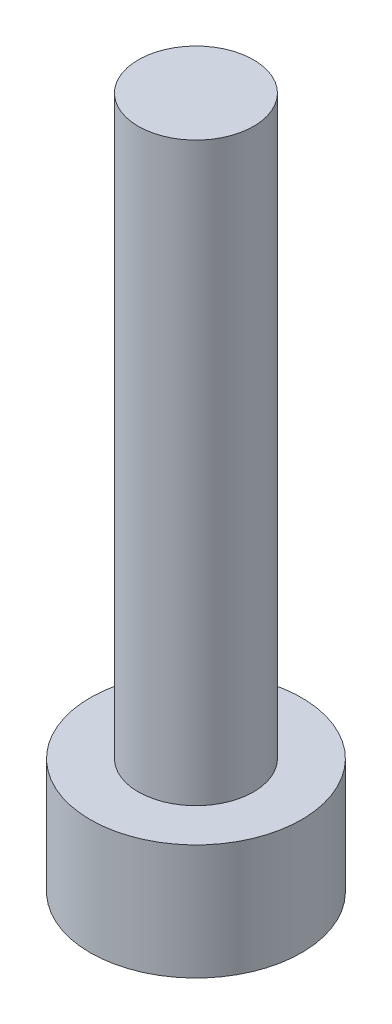
ISO-10303-21;
HEADER;
FILE_DESCRIPTION(('STEP AP214'),'2;1');
FILE_NAME('part.step','',(''),(''),'','','');
FILE_SCHEMA(('AUTOMOTIVE_DESIGN { 1 0 10303 214 1 1 1 1 }'));
ENDSEC;
DATA;
#1=APPLICATION_CONTEXT('core data for automotive mechanical design processes');
#2=APPLICATION_PROTOCOL_DEFINITION('international standard','automotive_design',2000,#1);
#3=PRODUCT_CONTEXT('',#1,'mechanical');
#4=PRODUCT('Part','Part','',(#3));
#5=PRODUCT_RELATED_PRODUCT_CATEGORY('part','',(#4));
#6=PRODUCT_DEFINITION_FORMATION('','',#4);
#7=PRODUCT_DEFINITION_CONTEXT('part definition',#1,'design');
#8=PRODUCT_DEFINITION('design','',#6,#7);
#9=PRODUCT_DEFINITION_SHAPE('','',#8);
#10=(LENGTH_UNIT() NAMED_UNIT(*) SI_UNIT(.MILLI.,.METRE.));
#11=(NAMED_UNIT(*) PLANE_ANGLE_UNIT() SI_UNIT($,.RADIAN.));
#12=(NAMED_UNIT(*) SI_UNIT($,.STERADIAN.) SOLID_ANGLE_UNIT());
#13=UNCERTAINTY_MEASURE_WITH_UNIT(LENGTH_MEASURE(1.E-05),#10,'distance_accuracy_value','');
#14=(GEOMETRIC_REPRESENTATION_CONTEXT(3) GLOBAL_UNCERTAINTY_ASSIGNED_CONTEXT((#13)) GLOBAL_UNIT_ASSIGNED_CONTEXT((#10,
#11,#12)) REPRESENTATION_CONTEXT('',''));
#15=CARTESIAN_POINT('',(0.,0.,0.));
#16=DIRECTION('',(0.,0.,1.));
#17=DIRECTION('',(1.,0.,0.));
#18=AXIS2_PLACEMENT_3D('',#15,#16,#17);
#19=CARTESIAN_POINT('',(0.,3.,0.));
#20=DIRECTION('',(0.,1.,0.));
#21=DIRECTION('',(0.,0.,1.));
#22=AXIS2_PLACEMENT_3D('',#19,#20,#21);
#23=PLANE('',#22);
#24=CARTESIAN_POINT('',(0.,3.,0.));
#25=DIRECTION('',(0.,1.,0.));
#26=DIRECTION('',(0.,0.,1.));
#27=AXIS2_PLACEMENT_3D('',#24,#25,#26);
#28=CIRCLE('',#27,2.75);
#29=CARTESIAN_POINT('',(0.,3.,2.75));
#30=VERTEX_POINT('',#29);
#31=EDGE_CURVE('E11',#30,#30,#28,.T.);
#32=ORIENTED_EDGE('',*,*,#31,.T.);
#33=EDGE_LOOP('',(#32));
#34=FACE_BOUND('',#33,.T.);
#35=CARTESIAN_POINT('',(0.,3.,0.));
#36=DIRECTION('',(0.,1.,0.));
#37=DIRECTION('',(0.,0.,1.));
#38=AXIS2_PLACEMENT_3D('',#35,#36,#37);
#39=CIRCLE('',#38,1.5);
#40=CARTESIAN_POINT('',(0.,3.,1.5));
#41=VERTEX_POINT('',#40);
#42=EDGE_CURVE('E135',#41,#41,#39,.T.);
#43=ORIENTED_EDGE('',*,*,#42,.F.);
#44=EDGE_LOOP('',(#43));
#45=FACE_BOUND('',#44,.T.);
#46=ADVANCED_FACE('F33',(#34,#45),#23,.T.);
#47=CARTESIAN_POINT('',(0.,3.,0.));
#48=DIRECTION('',(0.,-1.,0.));
#49=DIRECTION('',(0.,0.,-1.));
#50=AXIS2_PLACEMENT_3D('',#47,#48,#49);
#51=CYLINDRICAL_SURFACE('',#50,2.75);
#52=ORIENTED_EDGE('',*,*,#31,.F.);
#53=EDGE_LOOP('',(#52));
#54=FACE_BOUND('',#53,.T.);
#55=CARTESIAN_POINT('',(0.,0.,0.));
#56=DIRECTION('',(0.,1.,0.));
#57=DIRECTION('',(0.,0.,1.));
#58=AXIS2_PLACEMENT_3D('',#55,#56,#57);
#59=CIRCLE('',#58,2.75);
#60=CARTESIAN_POINT('',(0.,0.,2.75));
#61=VERTEX_POINT('',#60);
#62=EDGE_CURVE('E37',#61,#61,#59,.T.);
#63=ORIENTED_EDGE('',*,*,#62,.T.);
#64=EDGE_LOOP('',(#63));
#65=FACE_BOUND('',#64,.T.);
#66=ADVANCED_FACE('F35',(#54,#65),#51,.T.);
#67=CARTESIAN_POINT('',(0.,0.,0.));
#68=DIRECTION('',(0.,1.,0.));
#69=DIRECTION('',(0.,0.,1.));
#70=AXIS2_PLACEMENT_3D('',#67,#68,#69);
#71=PLANE('',#70);
#72=DIRECTION('',(-0.866025403784439,0.,-0.5));
#73=VECTOR('',#72,1.);
#74=CARTESIAN_POINT('',(0.,0.,1.44337567297406));
#75=LINE('',#74,#73);
#76=CARTESIAN_POINT('',(0.,0.,1.44337567297406));
#77=VERTEX_POINT('',#76);
#78=CARTESIAN_POINT('',(-1.25,0.,0.721687836487033));
#79=VERTEX_POINT('',#78);
#80=EDGE_CURVE('E122',#77,#79,#75,.T.);
#81=ORIENTED_EDGE('',*,*,#80,.F.);
#82=DIRECTION('',(-0.866025403784439,0.,0.5));
#83=VECTOR('',#82,1.);
#84=CARTESIAN_POINT('',(1.25,0.,0.721687836487032));
#85=LINE('',#84,#83);
#86=CARTESIAN_POINT('',(1.25,0.,0.721687836487032));
#87=VERTEX_POINT('',#86);
#88=EDGE_CURVE('E48',#87,#77,#85,.T.);
#89=ORIENTED_EDGE('',*,*,#88,.F.);
#90=DIRECTION('',(0.,0.,1.));
#91=VECTOR('',#90,1.);
#92=CARTESIAN_POINT('',(1.25,0.,-0.721687836487033));
#93=LINE('',#92,#91);
#94=CARTESIAN_POINT('',(1.25,0.,-0.721687836487033));
#95=VERTEX_POINT('',#94);
#96=EDGE_CURVE('E131',#95,#87,#93,.T.);
#97=ORIENTED_EDGE('',*,*,#96,.F.);
#98=DIRECTION('',(0.866025403784439,0.,0.5));
#99=VECTOR('',#98,1.);
#100=CARTESIAN_POINT('',(0.,0.,-1.44337567297406));
#101=LINE('',#100,#99);
#102=CARTESIAN_POINT('',(0.,0.,-1.44337567297406));
#103=VERTEX_POINT('',#102);
#104=EDGE_CURVE('E129',#103,#95,#101,.T.);
#105=ORIENTED_EDGE('',*,*,#104,.F.);
#106=DIRECTION('',(0.866025403784439,0.,-0.5));
#107=VECTOR('',#106,1.);
#108=CARTESIAN_POINT('',(-1.25,0.,-0.721687836487032));
#109=LINE('',#108,#107);
#110=CARTESIAN_POINT('',(-1.25,0.,-0.721687836487032));
#111=VERTEX_POINT('',#110);
#112=EDGE_CURVE('E96',#111,#103,#109,.T.);
#113=ORIENTED_EDGE('',*,*,#112,.F.);
#114=DIRECTION('',(0.,0.,-1.));
#115=VECTOR('',#114,1.);
#116=CARTESIAN_POINT('',(-1.25,0.,0.721687836487033));
#117=LINE('',#116,#115);
#118=EDGE_CURVE('E125',#79,#111,#117,.T.);
#119=ORIENTED_EDGE('',*,*,#118,.F.);
#120=EDGE_LOOP('',(#81,#89,#97,#105,#113,#119));
#121=FACE_BOUND('',#120,.T.);
#122=ORIENTED_EDGE('',*,*,#62,.F.);
#123=EDGE_LOOP('',(#122));
#124=FACE_BOUND('',#123,.T.);
#125=ADVANCED_FACE('F155',(#121,#124),#71,.F.);
#126=CARTESIAN_POINT('',(0.,18.,0.));
#127=DIRECTION('',(0.,-1.,0.));
#128=DIRECTION('',(0.,0.,-1.));
#129=AXIS2_PLACEMENT_3D('',#126,#127,#128);
#130=CYLINDRICAL_SURFACE('',#129,1.5);
#131=CARTESIAN_POINT('',(0.,18.,0.));
#132=DIRECTION('',(0.,1.,0.));
#133=DIRECTION('',(0.,0.,1.));
#134=AXIS2_PLACEMENT_3D('',#131,#132,#133);
#135=CIRCLE('',#134,1.5);
#136=CARTESIAN_POINT('',(0.,18.,1.5));
#137=VERTEX_POINT('',#136);
#138=EDGE_CURVE('E141',#137,#137,#135,.T.);
#139=ORIENTED_EDGE('',*,*,#138,.F.);
#140=EDGE_LOOP('',(#139));
#141=FACE_BOUND('',#140,.T.);
#142=ORIENTED_EDGE('',*,*,#42,.T.);
#143=EDGE_LOOP('',(#142));
#144=FACE_BOUND('',#143,.T.);
#145=ADVANCED_FACE('F147',(#141,#144),#130,.T.);
#146=CARTESIAN_POINT('',(0.,18.,0.));
#147=DIRECTION('',(0.,1.,0.));
#148=DIRECTION('',(0.,0.,1.));
#149=AXIS2_PLACEMENT_3D('',#146,#147,#148);
#150=PLANE('',#149);
#151=ORIENTED_EDGE('',*,*,#138,.T.);
#152=EDGE_LOOP('',(#151));
#153=FACE_BOUND('',#152,.T.);
#154=ADVANCED_FACE('F164',(#153),#150,.T.);
#155=CARTESIAN_POINT('',(1.25,1.5,0.721687836487032));
#156=DIRECTION('',(0.5,0.,0.866025403784439));
#157=DIRECTION('',(0.866025403784439,0.,-0.5));
#158=AXIS2_PLACEMENT_3D('',#155,#156,#157);
#159=PLANE('',#158);
#160=ORIENTED_EDGE('',*,*,#88,.T.);
#161=DIRECTION('',(0.,-1.,0.));
#162=VECTOR('',#161,1.);
#163=CARTESIAN_POINT('',(0.,1.5,1.44337567297406));
#164=LINE('',#163,#162);
#165=CARTESIAN_POINT('',(0.,1.5,1.44337567297406));
#166=VERTEX_POINT('',#165);
#167=EDGE_CURVE('E78',#166,#77,#164,.T.);
#168=ORIENTED_EDGE('',*,*,#167,.F.);
#169=DIRECTION('',(-0.866025403784439,0.,0.5));
#170=VECTOR('',#169,1.);
#171=CARTESIAN_POINT('',(1.25,1.5,0.721687836487032));
#172=LINE('',#171,#170);
#173=CARTESIAN_POINT('',(1.25,1.5,0.721687836487032));
#174=VERTEX_POINT('',#173);
#175=EDGE_CURVE('E133',#174,#166,#172,.T.);
#176=ORIENTED_EDGE('',*,*,#175,.F.);
#177=DIRECTION('',(0.,-1.,0.));
#178=VECTOR('',#177,1.);
#179=CARTESIAN_POINT('',(1.25,1.5,0.721687836487032));
#180=LINE('',#179,#178);
#181=EDGE_CURVE('E56',#174,#87,#180,.T.);
#182=ORIENTED_EDGE('',*,*,#181,.T.);
#183=EDGE_LOOP('',(#160,#168,#176,#182));
#184=FACE_BOUND('',#183,.T.);
#185=ADVANCED_FACE('F176',(#184),#159,.F.);
#186=CARTESIAN_POINT('',(1.25,1.5,-0.721687836487033));
#187=DIRECTION('',(1.,0.,0.));
#188=DIRECTION('',(0.,0.,-1.));
#189=AXIS2_PLACEMENT_3D('',#186,#187,#188);
#190=PLANE('',#189);
#191=ORIENTED_EDGE('',*,*,#96,.T.);
#192=ORIENTED_EDGE('',*,*,#181,.F.);
#193=DIRECTION('',(0.,0.,1.));
#194=VECTOR('',#193,1.);
#195=CARTESIAN_POINT('',(1.25,1.5,-0.721687836487033));
#196=LINE('',#195,#194);
#197=CARTESIAN_POINT('',(1.25,1.5,-0.721687836487033));
#198=VERTEX_POINT('',#197);
#199=EDGE_CURVE('E108',#198,#174,#196,.T.);
#200=ORIENTED_EDGE('',*,*,#199,.F.);
#201=DIRECTION('',(0.,-1.,0.));
#202=VECTOR('',#201,1.);
#203=CARTESIAN_POINT('',(1.25,1.5,-0.721687836487033));
#204=LINE('',#203,#202);
#205=EDGE_CURVE('E100',#198,#95,#204,.T.);
#206=ORIENTED_EDGE('',*,*,#205,.T.);
#207=EDGE_LOOP('',(#191,#192,#200,#206));
#208=FACE_BOUND('',#207,.T.);
#209=ADVANCED_FACE('F178',(#208),#190,.F.);
#210=CARTESIAN_POINT('',(0.,1.5,-1.44337567297406));
#211=DIRECTION('',(0.5,0.,-0.866025403784439));
#212=DIRECTION('',(-0.866025403784439,0.,-0.5));
#213=AXIS2_PLACEMENT_3D('',#210,#211,#212);
#214=PLANE('',#213);
#215=ORIENTED_EDGE('',*,*,#104,.T.);
#216=ORIENTED_EDGE('',*,*,#205,.F.);
#217=DIRECTION('',(0.866025403784439,0.,0.5));
#218=VECTOR('',#217,1.);
#219=CARTESIAN_POINT('',(0.,1.5,-1.44337567297406));
#220=LINE('',#219,#218);
#221=CARTESIAN_POINT('',(0.,1.5,-1.44337567297406));
#222=VERTEX_POINT('',#221);
#223=EDGE_CURVE('E104',#222,#198,#220,.T.);
#224=ORIENTED_EDGE('',*,*,#223,.F.);
#225=DIRECTION('',(0.,-1.,0.));
#226=VECTOR('',#225,1.);
#227=CARTESIAN_POINT('',(0.,1.5,-1.44337567297406));
#228=LINE('',#227,#226);
#229=EDGE_CURVE('E89',#222,#103,#228,.T.);
#230=ORIENTED_EDGE('',*,*,#229,.T.);
#231=EDGE_LOOP('',(#215,#216,#224,#230));
#232=FACE_BOUND('',#231,.T.);
#233=ADVANCED_FACE('F105',(#232),#214,.F.);
#234=CARTESIAN_POINT('',(-1.25,1.5,-0.721687836487032));
#235=DIRECTION('',(-0.5,0.,-0.866025403784439));
#236=DIRECTION('',(-0.866025403784439,0.,0.5));
#237=AXIS2_PLACEMENT_3D('',#234,#235,#236);
#238=PLANE('',#237);
#239=ORIENTED_EDGE('',*,*,#112,.T.);
#240=ORIENTED_EDGE('',*,*,#229,.F.);
#241=DIRECTION('',(0.866025403784439,0.,-0.5));
#242=VECTOR('',#241,1.);
#243=CARTESIAN_POINT('',(-1.25,1.5,-0.721687836487032));
#244=LINE('',#243,#242);
#245=CARTESIAN_POINT('',(-1.25,1.5,-0.721687836487032));
#246=VERTEX_POINT('',#245);
#247=EDGE_CURVE('E93',#246,#222,#244,.T.);
#248=ORIENTED_EDGE('',*,*,#247,.F.);
#249=DIRECTION('',(0.,-1.,0.));
#250=VECTOR('',#249,1.);
#251=CARTESIAN_POINT('',(-1.25,1.5,-0.721687836487032));
#252=LINE('',#251,#250);
#253=EDGE_CURVE('E101',#246,#111,#252,.T.);
#254=ORIENTED_EDGE('',*,*,#253,.T.);
#255=EDGE_LOOP('',(#239,#240,#248,#254));
#256=FACE_BOUND('',#255,.T.);
#257=ADVANCED_FACE('F91',(#256),#238,.F.);
#258=CARTESIAN_POINT('',(-1.25,1.5,0.721687836487033));
#259=DIRECTION('',(-1.,0.,0.));
#260=DIRECTION('',(0.,0.,1.));
#261=AXIS2_PLACEMENT_3D('',#258,#259,#260);
#262=PLANE('',#261);
#263=ORIENTED_EDGE('',*,*,#118,.T.);
#264=ORIENTED_EDGE('',*,*,#253,.F.);
#265=DIRECTION('',(0.,0.,-1.));
#266=VECTOR('',#265,1.);
#267=CARTESIAN_POINT('',(-1.25,1.5,0.721687836487033));
#268=LINE('',#267,#266);
#269=CARTESIAN_POINT('',(-1.25,1.5,0.721687836487033));
#270=VERTEX_POINT('',#269);
#271=EDGE_CURVE('E114',#270,#246,#268,.T.);
#272=ORIENTED_EDGE('',*,*,#271,.F.);
#273=DIRECTION('',(0.,-1.,0.));
#274=VECTOR('',#273,1.);
#275=CARTESIAN_POINT('',(-1.25,1.5,0.721687836487033));
#276=LINE('',#275,#274);
#277=EDGE_CURVE('E138',#270,#79,#276,.T.);
#278=ORIENTED_EDGE('',*,*,#277,.T.);
#279=EDGE_LOOP('',(#263,#264,#272,#278));
#280=FACE_BOUND('',#279,.T.);
#281=ADVANCED_FACE('F189',(#280),#262,.F.);
#282=CARTESIAN_POINT('',(0.,1.5,1.44337567297406));
#283=DIRECTION('',(-0.5,0.,0.866025403784439));
#284=DIRECTION('',(0.866025403784439,0.,0.5));
#285=AXIS2_PLACEMENT_3D('',#282,#283,#284);
#286=PLANE('',#285);
#287=ORIENTED_EDGE('',*,*,#80,.T.);
#288=ORIENTED_EDGE('',*,*,#277,.F.);
#289=DIRECTION('',(-0.866025403784439,0.,-0.5));
#290=VECTOR('',#289,1.);
#291=CARTESIAN_POINT('',(0.,1.5,1.44337567297406));
#292=LINE('',#291,#290);
#293=EDGE_CURVE('E116',#166,#270,#292,.T.);
#294=ORIENTED_EDGE('',*,*,#293,.F.);
#295=ORIENTED_EDGE('',*,*,#167,.T.);
#296=EDGE_LOOP('',(#287,#288,#294,#295));
#297=FACE_BOUND('',#296,.T.);
#298=ADVANCED_FACE('F174',(#297),#286,.F.);
#299=CARTESIAN_POINT('',(0.,1.5,0.));
#300=DIRECTION('',(0.,-1.,0.));
#301=DIRECTION('',(0.,0.,-1.));
#302=AXIS2_PLACEMENT_3D('',#299,#300,#301);
#303=PLANE('',#302);
#304=ORIENTED_EDGE('',*,*,#175,.T.);
#305=ORIENTED_EDGE('',*,*,#293,.T.);
#306=ORIENTED_EDGE('',*,*,#271,.T.);
#307=ORIENTED_EDGE('',*,*,#247,.T.);
#308=ORIENTED_EDGE('',*,*,#223,.T.);
#309=ORIENTED_EDGE('',*,*,#199,.T.);
#310=EDGE_LOOP('',(#304,#305,#306,#307,#308,#309));
#311=FACE_BOUND('',#310,.T.);
#312=ADVANCED_FACE('F111',(#311),#303,.T.);
#313=CLOSED_SHELL('',(#46,#66,#125,#145,#154,#185,#209,#233,#257,#281,#298,#312));
#314=MANIFOLD_SOLID_BREP('B2',#313);
#315=ADVANCED_BREP_SHAPE_REPRESENTATION('',(#18,#314),#14);
#316=SHAPE_DEFINITION_REPRESENTATION(#9,#315);
ENDSEC;
END-ISO-10303-21;
